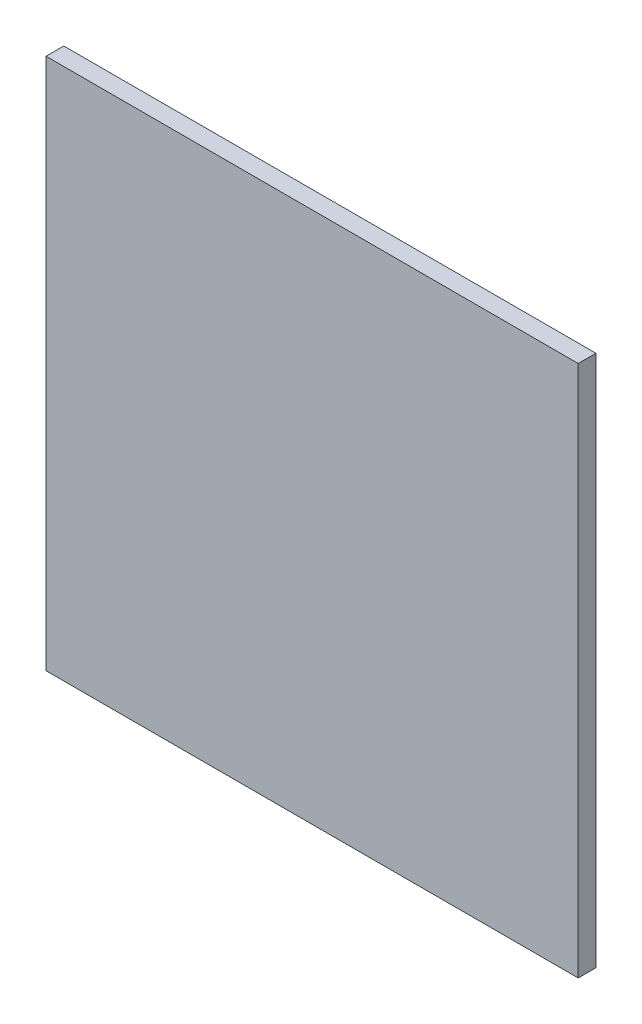
ISO-10303-21;
HEADER;
FILE_DESCRIPTION(('STEP AP214'),'2;1');
FILE_NAME('part.step','',(''),(''),'','','');
FILE_SCHEMA(('AUTOMOTIVE_DESIGN { 1 0 10303 214 1 1 1 1 }'));
ENDSEC;
DATA;
#1=APPLICATION_CONTEXT('core data for automotive mechanical design processes');
#2=APPLICATION_PROTOCOL_DEFINITION('international standard','automotive_design',2000,#1);
#3=PRODUCT_CONTEXT('',#1,'mechanical');
#4=PRODUCT('Part','Part','',(#3));
#5=PRODUCT_RELATED_PRODUCT_CATEGORY('part','',(#4));
#6=PRODUCT_DEFINITION_FORMATION('','',#4);
#7=PRODUCT_DEFINITION_CONTEXT('part definition',#1,'design');
#8=PRODUCT_DEFINITION('design','',#6,#7);
#9=PRODUCT_DEFINITION_SHAPE('','',#8);
#10=(LENGTH_UNIT() NAMED_UNIT(*) SI_UNIT(.MILLI.,.METRE.));
#11=(NAMED_UNIT(*) PLANE_ANGLE_UNIT() SI_UNIT($,.RADIAN.));
#12=(NAMED_UNIT(*) SI_UNIT($,.STERADIAN.) SOLID_ANGLE_UNIT());
#13=UNCERTAINTY_MEASURE_WITH_UNIT(LENGTH_MEASURE(1.E-05),#10,'distance_accuracy_value','');
#14=(GEOMETRIC_REPRESENTATION_CONTEXT(3) GLOBAL_UNCERTAINTY_ASSIGNED_CONTEXT((#13)) GLOBAL_UNIT_ASSIGNED_CONTEXT((#10,
#11,#12)) REPRESENTATION_CONTEXT('',''));
#15=CARTESIAN_POINT('',(0.,0.,0.));
#16=DIRECTION('',(0.,0.,1.));
#17=DIRECTION('',(1.,0.,0.));
#18=AXIS2_PLACEMENT_3D('',#15,#16,#17);
#19=CARTESIAN_POINT('',(0.,0.,25.4));
#20=DIRECTION('',(1.,0.,0.));
#21=DIRECTION('',(0.,0.,-1.));
#22=AXIS2_PLACEMENT_3D('',#19,#20,#21);
#23=PLANE('',#22);
#24=DIRECTION('',(0.,-1.,0.));
#25=VECTOR('',#24,1.);
#26=CARTESIAN_POINT('',(0.,0.,0.));
#27=LINE('',#26,#25);
#28=CARTESIAN_POINT('',(0.,762.,0.));
#29=VERTEX_POINT('',#28);
#30=CARTESIAN_POINT('',(0.,0.,0.));
#31=VERTEX_POINT('',#30);
#32=EDGE_CURVE('E113',#29,#31,#27,.T.);
#33=ORIENTED_EDGE('',*,*,#32,.T.);
#34=DIRECTION('',(0.,0.,-1.));
#35=VECTOR('',#34,1.);
#36=CARTESIAN_POINT('',(0.,0.,25.4));
#37=LINE('',#36,#35);
#38=CARTESIAN_POINT('',(0.,0.,25.4));
#39=VERTEX_POINT('',#38);
#40=EDGE_CURVE('E11',#39,#31,#37,.T.);
#41=ORIENTED_EDGE('',*,*,#40,.F.);
#42=DIRECTION('',(0.,-1.,0.));
#43=VECTOR('',#42,1.);
#44=CARTESIAN_POINT('',(0.,0.,25.4));
#45=LINE('',#44,#43);
#46=CARTESIAN_POINT('',(0.,762.,25.4));
#47=VERTEX_POINT('',#46);
#48=EDGE_CURVE('E97',#47,#39,#45,.T.);
#49=ORIENTED_EDGE('',*,*,#48,.F.);
#50=DIRECTION('',(0.,0.,-1.));
#51=VECTOR('',#50,1.);
#52=CARTESIAN_POINT('',(0.,762.,25.4));
#53=LINE('',#52,#51);
#54=EDGE_CURVE('E109',#47,#29,#53,.T.);
#55=ORIENTED_EDGE('',*,*,#54,.T.);
#56=EDGE_LOOP('',(#33,#41,#49,#55));
#57=FACE_BOUND('',#56,.T.);
#58=ADVANCED_FACE('F45',(#57),#23,.F.);
#59=CARTESIAN_POINT('',(0.,0.,25.4));
#60=DIRECTION('',(0.,1.,0.));
#61=DIRECTION('',(0.,0.,1.));
#62=AXIS2_PLACEMENT_3D('',#59,#60,#61);
#63=PLANE('',#62);
#64=DIRECTION('',(1.,0.,0.));
#65=VECTOR('',#64,1.);
#66=CARTESIAN_POINT('',(0.,0.,0.));
#67=LINE('',#66,#65);
#68=CARTESIAN_POINT('',(762.,0.,0.));
#69=VERTEX_POINT('',#68);
#70=EDGE_CURVE('E102',#31,#69,#67,.T.);
#71=ORIENTED_EDGE('',*,*,#70,.T.);
#72=DIRECTION('',(0.,0.,-1.));
#73=VECTOR('',#72,1.);
#74=CARTESIAN_POINT('',(762.,0.,25.4));
#75=LINE('',#74,#73);
#76=CARTESIAN_POINT('',(762.,0.,25.4));
#77=VERTEX_POINT('',#76);
#78=EDGE_CURVE('E54',#77,#69,#75,.T.);
#79=ORIENTED_EDGE('',*,*,#78,.F.);
#80=DIRECTION('',(1.,0.,0.));
#81=VECTOR('',#80,1.);
#82=CARTESIAN_POINT('',(0.,0.,25.4));
#83=LINE('',#82,#81);
#84=EDGE_CURVE('E92',#39,#77,#83,.T.);
#85=ORIENTED_EDGE('',*,*,#84,.F.);
#86=ORIENTED_EDGE('',*,*,#40,.T.);
#87=EDGE_LOOP('',(#71,#79,#85,#86));
#88=FACE_BOUND('',#87,.T.);
#89=ADVANCED_FACE('F101',(#88),#63,.F.);
#90=CARTESIAN_POINT('',(762.,0.,25.4));
#91=DIRECTION('',(-1.,0.,0.));
#92=DIRECTION('',(0.,0.,1.));
#93=AXIS2_PLACEMENT_3D('',#90,#91,#92);
#94=PLANE('',#93);
#95=DIRECTION('',(0.,1.,0.));
#96=VECTOR('',#95,1.);
#97=CARTESIAN_POINT('',(762.,0.,0.));
#98=LINE('',#97,#96);
#99=CARTESIAN_POINT('',(762.,762.,0.));
#100=VERTEX_POINT('',#99);
#101=EDGE_CURVE('E79',#69,#100,#98,.T.);
#102=ORIENTED_EDGE('',*,*,#101,.T.);
#103=DIRECTION('',(0.,0.,-1.));
#104=VECTOR('',#103,1.);
#105=CARTESIAN_POINT('',(762.,762.,25.4));
#106=LINE('',#105,#104);
#107=CARTESIAN_POINT('',(762.,762.,25.4));
#108=VERTEX_POINT('',#107);
#109=EDGE_CURVE('E104',#108,#100,#106,.T.);
#110=ORIENTED_EDGE('',*,*,#109,.F.);
#111=DIRECTION('',(0.,1.,0.));
#112=VECTOR('',#111,1.);
#113=CARTESIAN_POINT('',(762.,0.,25.4));
#114=LINE('',#113,#112);
#115=EDGE_CURVE('E95',#77,#108,#114,.T.);
#116=ORIENTED_EDGE('',*,*,#115,.F.);
#117=ORIENTED_EDGE('',*,*,#78,.T.);
#118=EDGE_LOOP('',(#102,#110,#116,#117));
#119=FACE_BOUND('',#118,.T.);
#120=ADVANCED_FACE('F105',(#119),#94,.F.);
#121=CARTESIAN_POINT('',(0.,762.,25.4));
#122=DIRECTION('',(0.,-1.,0.));
#123=DIRECTION('',(0.,0.,-1.));
#124=AXIS2_PLACEMENT_3D('',#121,#122,#123);
#125=PLANE('',#124);
#126=DIRECTION('',(-1.,0.,0.));
#127=VECTOR('',#126,1.);
#128=CARTESIAN_POINT('',(0.,762.,0.));
#129=LINE('',#128,#127);
#130=EDGE_CURVE('E85',#100,#29,#129,.T.);
#131=ORIENTED_EDGE('',*,*,#130,.T.);
#132=ORIENTED_EDGE('',*,*,#54,.F.);
#133=DIRECTION('',(-1.,0.,0.));
#134=VECTOR('',#133,1.);
#135=CARTESIAN_POINT('',(0.,762.,25.4));
#136=LINE('',#135,#134);
#137=EDGE_CURVE('E62',#108,#47,#136,.T.);
#138=ORIENTED_EDGE('',*,*,#137,.F.);
#139=ORIENTED_EDGE('',*,*,#109,.T.);
#140=EDGE_LOOP('',(#131,#132,#138,#139));
#141=FACE_BOUND('',#140,.T.);
#142=ADVANCED_FACE('F126',(#141),#125,.F.);
#143=CARTESIAN_POINT('',(0.,0.,25.4));
#144=DIRECTION('',(0.,0.,-1.));
#145=DIRECTION('',(-1.,0.,0.));
#146=AXIS2_PLACEMENT_3D('',#143,#144,#145);
#147=PLANE('',#146);
#148=ORIENTED_EDGE('',*,*,#48,.T.);
#149=ORIENTED_EDGE('',*,*,#84,.T.);
#150=ORIENTED_EDGE('',*,*,#115,.T.);
#151=ORIENTED_EDGE('',*,*,#137,.T.);
#152=EDGE_LOOP('',(#148,#149,#150,#151));
#153=FACE_BOUND('',#152,.T.);
#154=ADVANCED_FACE('F93',(#153),#147,.F.);
#155=CARTESIAN_POINT('',(0.,0.,0.));
#156=DIRECTION('',(0.,0.,-1.));
#157=DIRECTION('',(-1.,0.,0.));
#158=AXIS2_PLACEMENT_3D('',#155,#156,#157);
#159=PLANE('',#158);
#160=ORIENTED_EDGE('',*,*,#32,.F.);
#161=ORIENTED_EDGE('',*,*,#130,.F.);
#162=ORIENTED_EDGE('',*,*,#101,.F.);
#163=ORIENTED_EDGE('',*,*,#70,.F.);
#164=EDGE_LOOP('',(#160,#161,#162,#163));
#165=FACE_BOUND('',#164,.T.);
#166=ADVANCED_FACE('F129',(#165),#159,.T.);
#167=CLOSED_SHELL('',(#58,#89,#120,#142,#154,#166));
#168=MANIFOLD_SOLID_BREP('B2',#167);
#169=ADVANCED_BREP_SHAPE_REPRESENTATION('',(#18,#168),#14);
#170=SHAPE_DEFINITION_REPRESENTATION(#9,#169);
ENDSEC;
END-ISO-10303-21;
